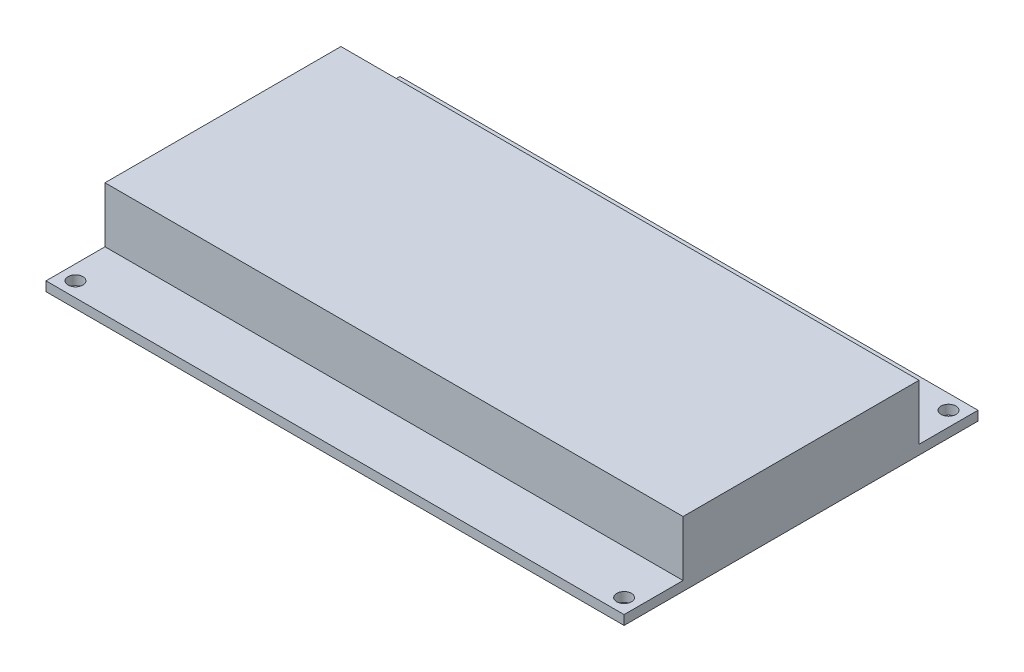
ISO-10303-21;
HEADER;
FILE_DESCRIPTION(('STEP AP214'),'2;1');
FILE_NAME('part.step','',(''),(''),'','','');
FILE_SCHEMA(('AUTOMOTIVE_DESIGN { 1 0 10303 214 1 1 1 1 }'));
ENDSEC;
DATA;
#1=APPLICATION_CONTEXT('core data for automotive mechanical design processes');
#2=APPLICATION_PROTOCOL_DEFINITION('international standard','automotive_design',2000,#1);
#3=PRODUCT_CONTEXT('',#1,'mechanical');
#4=PRODUCT('Part','Part','',(#3));
#5=PRODUCT_RELATED_PRODUCT_CATEGORY('part','',(#4));
#6=PRODUCT_DEFINITION_FORMATION('','',#4);
#7=PRODUCT_DEFINITION_CONTEXT('part definition',#1,'design');
#8=PRODUCT_DEFINITION('design','',#6,#7);
#9=PRODUCT_DEFINITION_SHAPE('','',#8);
#10=(LENGTH_UNIT() NAMED_UNIT(*) SI_UNIT(.MILLI.,.METRE.));
#11=(NAMED_UNIT(*) PLANE_ANGLE_UNIT() SI_UNIT($,.RADIAN.));
#12=(NAMED_UNIT(*) SI_UNIT($,.STERADIAN.) SOLID_ANGLE_UNIT());
#13=UNCERTAINTY_MEASURE_WITH_UNIT(LENGTH_MEASURE(1.E-05),#10,'distance_accuracy_value','');
#14=(GEOMETRIC_REPRESENTATION_CONTEXT(3) GLOBAL_UNCERTAINTY_ASSIGNED_CONTEXT((#13)) GLOBAL_UNIT_ASSIGNED_CONTEXT((#10,
#11,#12)) REPRESENTATION_CONTEXT('',''));
#15=CARTESIAN_POINT('',(0.,0.,0.));
#16=DIRECTION('',(0.,0.,1.));
#17=DIRECTION('',(1.,0.,0.));
#18=AXIS2_PLACEMENT_3D('',#15,#16,#17);
#19=CARTESIAN_POINT('',(0.,0.,0.));
#20=DIRECTION('',(0.,1.,0.));
#21=DIRECTION('',(0.,0.,1.));
#22=AXIS2_PLACEMENT_3D('',#19,#20,#21);
#23=PLANE('',#22);
#24=CARTESIAN_POINT('',(46.5,0.,-27.5));
#25=DIRECTION('',(0.,-1.,0.));
#26=DIRECTION('',(0.,0.,1.));
#27=AXIS2_PLACEMENT_3D('',#24,#25,#26);
#28=CIRCLE('',#27,1.25);
#29=CARTESIAN_POINT('',(46.5,0.,-26.25));
#30=VERTEX_POINT('',#29);
#31=EDGE_CURVE('E422',#30,#30,#28,.T.);
#32=ORIENTED_EDGE('',*,*,#31,.F.);
#33=EDGE_LOOP('',(#32));
#34=FACE_BOUND('',#33,.T.);
#35=CARTESIAN_POINT('',(-46.5,0.,-27.5));
#36=DIRECTION('',(0.,-1.,0.));
#37=DIRECTION('',(0.,0.,-1.));
#38=AXIS2_PLACEMENT_3D('',#35,#36,#37);
#39=CIRCLE('',#38,1.24999999999997);
#40=CARTESIAN_POINT('',(-46.5,0.,-28.75));
#41=VERTEX_POINT('',#40);
#42=EDGE_CURVE('E429',#41,#41,#39,.T.);
#43=ORIENTED_EDGE('',*,*,#42,.F.);
#44=EDGE_LOOP('',(#43));
#45=FACE_BOUND('',#44,.T.);
#46=CARTESIAN_POINT('',(-46.5,0.,27.5));
#47=DIRECTION('',(0.,-1.,0.));
#48=DIRECTION('',(0.,0.,1.));
#49=AXIS2_PLACEMENT_3D('',#46,#47,#48);
#50=CIRCLE('',#49,1.25000000000001);
#51=CARTESIAN_POINT('',(-46.5,0.,28.75));
#52=VERTEX_POINT('',#51);
#53=EDGE_CURVE('E440',#52,#52,#50,.T.);
#54=ORIENTED_EDGE('',*,*,#53,.F.);
#55=EDGE_LOOP('',(#54));
#56=FACE_BOUND('',#55,.T.);
#57=CARTESIAN_POINT('',(46.5,0.,27.5));
#58=DIRECTION('',(0.,-1.,0.));
#59=DIRECTION('',(0.,0.,-1.));
#60=AXIS2_PLACEMENT_3D('',#57,#58,#59);
#61=CIRCLE('',#60,1.25);
#62=CARTESIAN_POINT('',(46.5,0.,26.25));
#63=VERTEX_POINT('',#62);
#64=EDGE_CURVE('E258',#63,#63,#61,.T.);
#65=ORIENTED_EDGE('',*,*,#64,.F.);
#66=EDGE_LOOP('',(#65));
#67=FACE_BOUND('',#66,.T.);
#68=DIRECTION('',(0.,0.,-1.));
#69=VECTOR('',#68,1.);
#70=CARTESIAN_POINT('',(-39.,0.,-30.));
#71=LINE('',#70,#69);
#72=CARTESIAN_POINT('',(-39.,0.,-4.99999999999999));
#73=VERTEX_POINT('',#72);
#74=CARTESIAN_POINT('',(-39.,0.,-30.));
#75=VERTEX_POINT('',#74);
#76=EDGE_CURVE('E55',#73,#75,#71,.T.);
#77=ORIENTED_EDGE('',*,*,#76,.F.);
#78=DIRECTION('',(-1.,0.,0.));
#79=VECTOR('',#78,1.);
#80=CARTESIAN_POINT('',(-39.,0.,-4.99999999999999));
#81=LINE('',#80,#79);
#82=CARTESIAN_POINT('',(5.99999999999999,0.,-4.99999999999999));
#83=VERTEX_POINT('',#82);
#84=EDGE_CURVE('E149',#83,#73,#81,.T.);
#85=ORIENTED_EDGE('',*,*,#84,.F.);
#86=DIRECTION('',(0.,0.,1.));
#87=VECTOR('',#86,1.);
#88=CARTESIAN_POINT('',(5.99999999999999,0.,-30.));
#89=LINE('',#88,#87);
#90=CARTESIAN_POINT('',(5.99999999999999,0.,-30.));
#91=VERTEX_POINT('',#90);
#92=EDGE_CURVE('E244',#91,#83,#89,.T.);
#93=ORIENTED_EDGE('',*,*,#92,.F.);
#94=DIRECTION('',(-1.,0.,0.));
#95=VECTOR('',#94,1.);
#96=CARTESIAN_POINT('',(0.,0.,-30.));
#97=LINE('',#96,#95);
#98=CARTESIAN_POINT('',(49.,0.,-30.));
#99=VERTEX_POINT('',#98);
#100=EDGE_CURVE('E223',#99,#91,#97,.T.);
#101=ORIENTED_EDGE('',*,*,#100,.F.);
#102=DIRECTION('',(0.,0.,1.));
#103=VECTOR('',#102,1.);
#104=CARTESIAN_POINT('',(49.,0.,0.));
#105=LINE('',#104,#103);
#106=CARTESIAN_POINT('',(49.,0.,30.));
#107=VERTEX_POINT('',#106);
#108=EDGE_CURVE('E220',#99,#107,#105,.T.);
#109=ORIENTED_EDGE('',*,*,#108,.T.);
#110=DIRECTION('',(-1.,0.,0.));
#111=VECTOR('',#110,1.);
#112=CARTESIAN_POINT('',(0.,0.,30.));
#113=LINE('',#112,#111);
#114=CARTESIAN_POINT('',(-49.,0.,30.));
#115=VERTEX_POINT('',#114);
#116=EDGE_CURVE('E216',#107,#115,#113,.T.);
#117=ORIENTED_EDGE('',*,*,#116,.T.);
#118=DIRECTION('',(0.,0.,1.));
#119=VECTOR('',#118,1.);
#120=CARTESIAN_POINT('',(-49.,0.,0.));
#121=LINE('',#120,#119);
#122=CARTESIAN_POINT('',(-49.,0.,-30.));
#123=VERTEX_POINT('',#122);
#124=EDGE_CURVE('E196',#123,#115,#121,.T.);
#125=ORIENTED_EDGE('',*,*,#124,.F.);
#126=EDGE_CURVE('E60',#75,#123,#97,.T.);
#127=ORIENTED_EDGE('',*,*,#126,.F.);
#128=EDGE_LOOP('',(#77,#85,#93,#101,#109,#117,#125,#127));
#129=FACE_BOUND('',#128,.T.);
#130=ADVANCED_FACE('F39',(#34,#45,#56,#67,#129),#23,.F.);
#131=CARTESIAN_POINT('',(0.,1.6,0.));
#132=DIRECTION('',(0.,1.,0.));
#133=DIRECTION('',(0.,0.,1.));
#134=AXIS2_PLACEMENT_3D('',#131,#132,#133);
#135=PLANE('',#134);
#136=CARTESIAN_POINT('',(46.5,1.6,-27.5));
#137=DIRECTION('',(0.,1.,0.));
#138=DIRECTION('',(0.,0.,1.));
#139=AXIS2_PLACEMENT_3D('',#136,#137,#138);
#140=CIRCLE('',#139,1.25);
#141=CARTESIAN_POINT('',(46.5,1.6,-26.25));
#142=VERTEX_POINT('',#141);
#143=EDGE_CURVE('E420',#142,#142,#140,.F.);
#144=ORIENTED_EDGE('',*,*,#143,.T.);
#145=EDGE_LOOP('',(#144));
#146=FACE_BOUND('',#145,.T.);
#147=CARTESIAN_POINT('',(-46.5,1.6,-27.5));
#148=DIRECTION('',(0.,1.,0.));
#149=DIRECTION('',(0.,0.,1.));
#150=AXIS2_PLACEMENT_3D('',#147,#148,#149);
#151=CIRCLE('',#150,1.24999999999997);
#152=CARTESIAN_POINT('',(-46.5,1.6,-26.25));
#153=VERTEX_POINT('',#152);
#154=EDGE_CURVE('E424',#153,#153,#151,.F.);
#155=ORIENTED_EDGE('',*,*,#154,.T.);
#156=EDGE_LOOP('',(#155));
#157=FACE_BOUND('',#156,.T.);
#158=DIRECTION('',(0.,0.,1.));
#159=VECTOR('',#158,1.);
#160=CARTESIAN_POINT('',(-49.,1.6,0.));
#161=LINE('',#160,#159);
#162=CARTESIAN_POINT('',(-49.,1.6,-30.));
#163=VERTEX_POINT('',#162);
#164=CARTESIAN_POINT('',(-49.,1.6,-20.));
#165=VERTEX_POINT('',#164);
#166=EDGE_CURVE('E197',#163,#165,#161,.T.);
#167=ORIENTED_EDGE('',*,*,#166,.T.);
#168=DIRECTION('',(1.,0.,0.));
#169=VECTOR('',#168,1.);
#170=CARTESIAN_POINT('',(0.,1.6,-20.));
#171=LINE('',#170,#169);
#172=CARTESIAN_POINT('',(49.,1.6,-20.));
#173=VERTEX_POINT('',#172);
#174=EDGE_CURVE('E189',#165,#173,#171,.T.);
#175=ORIENTED_EDGE('',*,*,#174,.T.);
#176=DIRECTION('',(0.,0.,1.));
#177=VECTOR('',#176,1.);
#178=CARTESIAN_POINT('',(49.,1.6,0.));
#179=LINE('',#178,#177);
#180=CARTESIAN_POINT('',(49.,1.6,-30.));
#181=VERTEX_POINT('',#180);
#182=EDGE_CURVE('E206',#181,#173,#179,.T.);
#183=ORIENTED_EDGE('',*,*,#182,.F.);
#184=DIRECTION('',(-1.,0.,0.));
#185=VECTOR('',#184,1.);
#186=CARTESIAN_POINT('',(0.,1.6,-30.));
#187=LINE('',#186,#185);
#188=EDGE_CURVE('E210',#181,#163,#187,.T.);
#189=ORIENTED_EDGE('',*,*,#188,.T.);
#190=EDGE_LOOP('',(#167,#175,#183,#189));
#191=FACE_BOUND('',#190,.T.);
#192=ADVANCED_FACE('F277',(#146,#157,#191),#135,.T.);
#193=CARTESIAN_POINT('',(-49.,1.6,0.));
#194=DIRECTION('',(1.,0.,0.));
#195=DIRECTION('',(0.,0.,-1.));
#196=AXIS2_PLACEMENT_3D('',#193,#194,#195);
#197=PLANE('',#196);
#198=CARTESIAN_POINT('',(-49.,1.6,20.));
#199=VERTEX_POINT('',#198);
#200=CARTESIAN_POINT('',(-49.,1.6,30.));
#201=VERTEX_POINT('',#200);
#202=EDGE_CURVE('E201',#199,#201,#161,.T.);
#203=ORIENTED_EDGE('',*,*,#202,.F.);
#204=DIRECTION('',(0.,-1.,0.));
#205=VECTOR('',#204,1.);
#206=CARTESIAN_POINT('',(-49.,11.,20.));
#207=LINE('',#206,#205);
#208=CARTESIAN_POINT('',(-49.,11.,20.));
#209=VERTEX_POINT('',#208);
#210=EDGE_CURVE('E173',#209,#199,#207,.T.);
#211=ORIENTED_EDGE('',*,*,#210,.F.);
#212=DIRECTION('',(0.,0.,1.));
#213=VECTOR('',#212,1.);
#214=CARTESIAN_POINT('',(-49.,11.,0.));
#215=LINE('',#214,#213);
#216=CARTESIAN_POINT('',(-49.,11.,-20.));
#217=VERTEX_POINT('',#216);
#218=EDGE_CURVE('E170',#217,#209,#215,.T.);
#219=ORIENTED_EDGE('',*,*,#218,.F.);
#220=DIRECTION('',(0.,-1.,0.));
#221=VECTOR('',#220,1.);
#222=CARTESIAN_POINT('',(-49.,11.,-20.));
#223=LINE('',#222,#221);
#224=EDGE_CURVE('E177',#217,#165,#223,.T.);
#225=ORIENTED_EDGE('',*,*,#224,.T.);
#226=ORIENTED_EDGE('',*,*,#166,.F.);
#227=DIRECTION('',(0.,-1.,0.));
#228=VECTOR('',#227,1.);
#229=CARTESIAN_POINT('',(-49.,1.6,-30.));
#230=LINE('',#229,#228);
#231=EDGE_CURVE('E213',#163,#123,#230,.T.);
#232=ORIENTED_EDGE('',*,*,#231,.T.);
#233=ORIENTED_EDGE('',*,*,#124,.T.);
#234=DIRECTION('',(0.,-1.,0.));
#235=VECTOR('',#234,1.);
#236=CARTESIAN_POINT('',(-49.,1.6,30.));
#237=LINE('',#236,#235);
#238=EDGE_CURVE('E11',#201,#115,#237,.T.);
#239=ORIENTED_EDGE('',*,*,#238,.F.);
#240=EDGE_LOOP('',(#203,#211,#219,#225,#226,#232,#233,#239));
#241=FACE_BOUND('',#240,.T.);
#242=ADVANCED_FACE('F41',(#241),#197,.F.);
#243=CARTESIAN_POINT('',(0.,1.6,30.));
#244=DIRECTION('',(0.,0.,1.));
#245=DIRECTION('',(1.,0.,0.));
#246=AXIS2_PLACEMENT_3D('',#243,#244,#245);
#247=PLANE('',#246);
#248=ORIENTED_EDGE('',*,*,#116,.F.);
#249=DIRECTION('',(0.,-1.,0.));
#250=VECTOR('',#249,1.);
#251=CARTESIAN_POINT('',(49.,1.6,30.));
#252=LINE('',#251,#250);
#253=CARTESIAN_POINT('',(49.,1.6,30.));
#254=VERTEX_POINT('',#253);
#255=EDGE_CURVE('E48',#254,#107,#252,.T.);
#256=ORIENTED_EDGE('',*,*,#255,.F.);
#257=DIRECTION('',(-1.,0.,0.));
#258=VECTOR('',#257,1.);
#259=CARTESIAN_POINT('',(0.,1.6,30.));
#260=LINE('',#259,#258);
#261=EDGE_CURVE('E200',#254,#201,#260,.T.);
#262=ORIENTED_EDGE('',*,*,#261,.T.);
#263=ORIENTED_EDGE('',*,*,#238,.T.);
#264=EDGE_LOOP('',(#248,#256,#262,#263));
#265=FACE_BOUND('',#264,.T.);
#266=ADVANCED_FACE('F240',(#265),#247,.T.);
#267=CARTESIAN_POINT('',(49.,1.6,0.));
#268=DIRECTION('',(1.,0.,0.));
#269=DIRECTION('',(0.,0.,-1.));
#270=AXIS2_PLACEMENT_3D('',#267,#268,#269);
#271=PLANE('',#270);
#272=ORIENTED_EDGE('',*,*,#255,.T.);
#273=ORIENTED_EDGE('',*,*,#108,.F.);
#274=DIRECTION('',(0.,-1.,0.));
#275=VECTOR('',#274,1.);
#276=CARTESIAN_POINT('',(49.,1.6,-30.));
#277=LINE('',#276,#275);
#278=EDGE_CURVE('E229',#181,#99,#277,.T.);
#279=ORIENTED_EDGE('',*,*,#278,.F.);
#280=ORIENTED_EDGE('',*,*,#182,.T.);
#281=DIRECTION('',(0.,-1.,0.));
#282=VECTOR('',#281,1.);
#283=CARTESIAN_POINT('',(49.,11.,-20.));
#284=LINE('',#283,#282);
#285=CARTESIAN_POINT('',(49.,11.,-20.));
#286=VERTEX_POINT('',#285);
#287=EDGE_CURVE('E181',#286,#173,#284,.T.);
#288=ORIENTED_EDGE('',*,*,#287,.F.);
#289=DIRECTION('',(0.,0.,1.));
#290=VECTOR('',#289,1.);
#291=CARTESIAN_POINT('',(49.,11.,0.));
#292=LINE('',#291,#290);
#293=CARTESIAN_POINT('',(49.,11.,20.));
#294=VERTEX_POINT('',#293);
#295=EDGE_CURVE('E158',#286,#294,#292,.T.);
#296=ORIENTED_EDGE('',*,*,#295,.T.);
#297=DIRECTION('',(0.,-1.,0.));
#298=VECTOR('',#297,1.);
#299=CARTESIAN_POINT('',(49.,11.,20.));
#300=LINE('',#299,#298);
#301=CARTESIAN_POINT('',(49.,1.6,20.));
#302=VERTEX_POINT('',#301);
#303=EDGE_CURVE('E185',#294,#302,#300,.T.);
#304=ORIENTED_EDGE('',*,*,#303,.T.);
#305=EDGE_CURVE('E205',#302,#254,#179,.T.);
#306=ORIENTED_EDGE('',*,*,#305,.T.);
#307=EDGE_LOOP('',(#272,#273,#279,#280,#288,#296,#304,#306));
#308=FACE_BOUND('',#307,.T.);
#309=ADVANCED_FACE('F237',(#308),#271,.T.);
#310=CARTESIAN_POINT('',(0.,1.6,-30.));
#311=DIRECTION('',(0.,0.,1.));
#312=DIRECTION('',(1.,0.,0.));
#313=AXIS2_PLACEMENT_3D('',#310,#311,#312);
#314=PLANE('',#313);
#315=ORIENTED_EDGE('',*,*,#100,.T.);
#316=DIRECTION('',(0.,1.,0.));
#317=VECTOR('',#316,1.);
#318=CARTESIAN_POINT('',(5.99999999999999,-13.,-30.));
#319=LINE('',#318,#317);
#320=CARTESIAN_POINT('',(5.99999999999999,-13.,-30.));
#321=VERTEX_POINT('',#320);
#322=EDGE_CURVE('E134',#321,#91,#319,.T.);
#323=ORIENTED_EDGE('',*,*,#322,.F.);
#324=DIRECTION('',(1.,0.,0.));
#325=VECTOR('',#324,1.);
#326=CARTESIAN_POINT('',(-39.,-13.,-30.));
#327=LINE('',#326,#325);
#328=CARTESIAN_POINT('',(-39.,-13.,-30.));
#329=VERTEX_POINT('',#328);
#330=EDGE_CURVE('E127',#329,#321,#327,.T.);
#331=ORIENTED_EDGE('',*,*,#330,.F.);
#332=DIRECTION('',(0.,1.,0.));
#333=VECTOR('',#332,1.);
#334=CARTESIAN_POINT('',(-39.,-13.,-30.));
#335=LINE('',#334,#333);
#336=EDGE_CURVE('E132',#329,#75,#335,.T.);
#337=ORIENTED_EDGE('',*,*,#336,.T.);
#338=ORIENTED_EDGE('',*,*,#126,.T.);
#339=ORIENTED_EDGE('',*,*,#231,.F.);
#340=ORIENTED_EDGE('',*,*,#188,.F.);
#341=ORIENTED_EDGE('',*,*,#278,.T.);
#342=EDGE_LOOP('',(#315,#323,#331,#337,#338,#339,#340,#341));
#343=FACE_BOUND('',#342,.T.);
#344=ADVANCED_FACE('F130',(#343),#314,.F.);
#345=CARTESIAN_POINT('',(-46.5,1.6,27.5));
#346=DIRECTION('',(0.,1.,0.));
#347=DIRECTION('',(0.,0.,1.));
#348=AXIS2_PLACEMENT_3D('',#345,#346,#347);
#349=CIRCLE('',#348,1.25000000000001);
#350=CARTESIAN_POINT('',(-46.5,1.6,28.75));
#351=VERTEX_POINT('',#350);
#352=EDGE_CURVE('E445',#351,#351,#349,.F.);
#353=ORIENTED_EDGE('',*,*,#352,.T.);
#354=EDGE_LOOP('',(#353));
#355=FACE_BOUND('',#354,.T.);
#356=CARTESIAN_POINT('',(46.5,1.6,27.5));
#357=DIRECTION('',(0.,1.,0.));
#358=DIRECTION('',(0.,0.,1.));
#359=AXIS2_PLACEMENT_3D('',#356,#357,#358);
#360=CIRCLE('',#359,1.25);
#361=CARTESIAN_POINT('',(46.5,1.6,28.75));
#362=VERTEX_POINT('',#361);
#363=EDGE_CURVE('E437',#362,#362,#360,.F.);
#364=ORIENTED_EDGE('',*,*,#363,.T.);
#365=EDGE_LOOP('',(#364));
#366=FACE_BOUND('',#365,.T.);
#367=DIRECTION('',(1.,0.,0.));
#368=VECTOR('',#367,1.);
#369=CARTESIAN_POINT('',(0.,1.6,20.));
#370=LINE('',#369,#368);
#371=EDGE_CURVE('E192',#199,#302,#370,.T.);
#372=ORIENTED_EDGE('',*,*,#371,.F.);
#373=ORIENTED_EDGE('',*,*,#202,.T.);
#374=ORIENTED_EDGE('',*,*,#261,.F.);
#375=ORIENTED_EDGE('',*,*,#305,.F.);
#376=EDGE_LOOP('',(#372,#373,#374,#375));
#377=FACE_BOUND('',#376,.T.);
#378=ADVANCED_FACE('F285',(#355,#366,#377),#135,.T.);
#379=CARTESIAN_POINT('',(0.,11.,20.));
#380=DIRECTION('',(0.,0.,1.));
#381=DIRECTION('',(1.,0.,0.));
#382=AXIS2_PLACEMENT_3D('',#379,#380,#381);
#383=PLANE('',#382);
#384=ORIENTED_EDGE('',*,*,#210,.T.);
#385=ORIENTED_EDGE('',*,*,#371,.T.);
#386=ORIENTED_EDGE('',*,*,#303,.F.);
#387=DIRECTION('',(-1.,0.,0.));
#388=VECTOR('',#387,1.);
#389=CARTESIAN_POINT('',(0.,11.,20.));
#390=LINE('',#389,#388);
#391=EDGE_CURVE('E153',#294,#209,#390,.T.);
#392=ORIENTED_EDGE('',*,*,#391,.T.);
#393=EDGE_LOOP('',(#384,#385,#386,#392));
#394=FACE_BOUND('',#393,.T.);
#395=ADVANCED_FACE('F306',(#394),#383,.T.);
#396=CARTESIAN_POINT('',(0.,11.,-20.));
#397=DIRECTION('',(0.,0.,1.));
#398=DIRECTION('',(1.,0.,0.));
#399=AXIS2_PLACEMENT_3D('',#396,#397,#398);
#400=PLANE('',#399);
#401=ORIENTED_EDGE('',*,*,#174,.F.);
#402=ORIENTED_EDGE('',*,*,#224,.F.);
#403=DIRECTION('',(-1.,0.,0.));
#404=VECTOR('',#403,1.);
#405=CARTESIAN_POINT('',(0.,11.,-20.));
#406=LINE('',#405,#404);
#407=EDGE_CURVE('E167',#286,#217,#406,.T.);
#408=ORIENTED_EDGE('',*,*,#407,.F.);
#409=ORIENTED_EDGE('',*,*,#287,.T.);
#410=EDGE_LOOP('',(#401,#402,#408,#409));
#411=FACE_BOUND('',#410,.T.);
#412=ADVANCED_FACE('F316',(#411),#400,.F.);
#413=CARTESIAN_POINT('',(0.,11.,0.));
#414=DIRECTION('',(0.,1.,0.));
#415=DIRECTION('',(0.,0.,1.));
#416=AXIS2_PLACEMENT_3D('',#413,#414,#415);
#417=PLANE('',#416);
#418=ORIENTED_EDGE('',*,*,#391,.F.);
#419=ORIENTED_EDGE('',*,*,#295,.F.);
#420=ORIENTED_EDGE('',*,*,#407,.T.);
#421=ORIENTED_EDGE('',*,*,#218,.T.);
#422=EDGE_LOOP('',(#418,#419,#420,#421));
#423=FACE_BOUND('',#422,.T.);
#424=ADVANCED_FACE('F310',(#423),#417,.T.);
#425=CARTESIAN_POINT('',(-39.,-13.,-30.));
#426=DIRECTION('',(1.,0.,0.));
#427=DIRECTION('',(0.,0.,-1.));
#428=AXIS2_PLACEMENT_3D('',#425,#426,#427);
#429=PLANE('',#428);
#430=ORIENTED_EDGE('',*,*,#76,.T.);
#431=ORIENTED_EDGE('',*,*,#336,.F.);
#432=DIRECTION('',(0.,0.,-1.));
#433=VECTOR('',#432,1.);
#434=CARTESIAN_POINT('',(-39.,-13.,-30.));
#435=LINE('',#434,#433);
#436=CARTESIAN_POINT('',(-39.,-13.,-4.99999999999999));
#437=VERTEX_POINT('',#436);
#438=EDGE_CURVE('E139',#437,#329,#435,.T.);
#439=ORIENTED_EDGE('',*,*,#438,.F.);
#440=DIRECTION('',(0.,1.,0.));
#441=VECTOR('',#440,1.);
#442=CARTESIAN_POINT('',(-39.,-13.,-4.99999999999999));
#443=LINE('',#442,#441);
#444=EDGE_CURVE('E253',#437,#73,#443,.T.);
#445=ORIENTED_EDGE('',*,*,#444,.T.);
#446=EDGE_LOOP('',(#430,#431,#439,#445));
#447=FACE_BOUND('',#446,.T.);
#448=ADVANCED_FACE('F151',(#447),#429,.F.);
#449=CARTESIAN_POINT('',(5.99999999999999,-13.,-30.));
#450=DIRECTION('',(-1.,0.,0.));
#451=DIRECTION('',(0.,0.,1.));
#452=AXIS2_PLACEMENT_3D('',#449,#450,#451);
#453=PLANE('',#452);
#454=ORIENTED_EDGE('',*,*,#92,.T.);
#455=DIRECTION('',(0.,1.,0.));
#456=VECTOR('',#455,1.);
#457=CARTESIAN_POINT('',(5.99999999999999,-13.,-4.99999999999999));
#458=LINE('',#457,#456);
#459=CARTESIAN_POINT('',(5.99999999999999,-13.,-4.99999999999999));
#460=VERTEX_POINT('',#459);
#461=EDGE_CURVE('E160',#460,#83,#458,.T.);
#462=ORIENTED_EDGE('',*,*,#461,.F.);
#463=DIRECTION('',(0.,0.,1.));
#464=VECTOR('',#463,1.);
#465=CARTESIAN_POINT('',(5.99999999999999,-13.,-30.));
#466=LINE('',#465,#464);
#467=EDGE_CURVE('E138',#321,#460,#466,.T.);
#468=ORIENTED_EDGE('',*,*,#467,.F.);
#469=ORIENTED_EDGE('',*,*,#322,.T.);
#470=EDGE_LOOP('',(#454,#462,#468,#469));
#471=FACE_BOUND('',#470,.T.);
#472=ADVANCED_FACE('F247',(#471),#453,.F.);
#473=CARTESIAN_POINT('',(-39.,-13.,-4.99999999999999));
#474=DIRECTION('',(0.,0.,-1.));
#475=DIRECTION('',(-1.,0.,0.));
#476=AXIS2_PLACEMENT_3D('',#473,#474,#475);
#477=PLANE('',#476);
#478=ORIENTED_EDGE('',*,*,#84,.T.);
#479=ORIENTED_EDGE('',*,*,#444,.F.);
#480=DIRECTION('',(-1.,0.,0.));
#481=VECTOR('',#480,1.);
#482=CARTESIAN_POINT('',(-39.,-13.,-4.99999999999999));
#483=LINE('',#482,#481);
#484=EDGE_CURVE('E144',#460,#437,#483,.T.);
#485=ORIENTED_EDGE('',*,*,#484,.F.);
#486=ORIENTED_EDGE('',*,*,#461,.T.);
#487=EDGE_LOOP('',(#478,#479,#485,#486));
#488=FACE_BOUND('',#487,.T.);
#489=ADVANCED_FACE('F266',(#488),#477,.F.);
#490=CARTESIAN_POINT('',(0.,-13.,0.));
#491=DIRECTION('',(0.,1.,0.));
#492=DIRECTION('',(0.,0.,1.));
#493=AXIS2_PLACEMENT_3D('',#490,#491,#492);
#494=PLANE('',#493);
#495=ORIENTED_EDGE('',*,*,#438,.T.);
#496=ORIENTED_EDGE('',*,*,#330,.T.);
#497=ORIENTED_EDGE('',*,*,#467,.T.);
#498=ORIENTED_EDGE('',*,*,#484,.T.);
#499=EDGE_LOOP('',(#495,#496,#497,#498));
#500=FACE_BOUND('',#499,.T.);
#501=ADVANCED_FACE('F142',(#500),#494,.F.);
#502=CARTESIAN_POINT('',(46.5,11.001,27.5));
#503=DIRECTION('',(0.,-1.,0.));
#504=DIRECTION('',(0.,0.,-1.));
#505=AXIS2_PLACEMENT_3D('',#502,#503,#504);
#506=CYLINDRICAL_SURFACE('',#505,1.25);
#507=ORIENTED_EDGE('',*,*,#363,.F.);
#508=EDGE_LOOP('',(#507));
#509=FACE_BOUND('',#508,.T.);
#510=ORIENTED_EDGE('',*,*,#64,.T.);
#511=EDGE_LOOP('',(#510));
#512=FACE_BOUND('',#511,.T.);
#513=ADVANCED_FACE('F273',(#509,#512),#506,.F.);
#514=CARTESIAN_POINT('',(-46.5,11.001,27.5));
#515=DIRECTION('',(0.,-1.,0.));
#516=DIRECTION('',(0.,0.,-1.));
#517=AXIS2_PLACEMENT_3D('',#514,#515,#516);
#518=CYLINDRICAL_SURFACE('',#517,1.25000000000001);
#519=ORIENTED_EDGE('',*,*,#352,.F.);
#520=EDGE_LOOP('',(#519));
#521=FACE_BOUND('',#520,.T.);
#522=ORIENTED_EDGE('',*,*,#53,.T.);
#523=EDGE_LOOP('',(#522));
#524=FACE_BOUND('',#523,.T.);
#525=ADVANCED_FACE('F383',(#521,#524),#518,.F.);
#526=CARTESIAN_POINT('',(-46.5,11.001,-27.5));
#527=DIRECTION('',(0.,-1.,0.));
#528=DIRECTION('',(0.,0.,-1.));
#529=AXIS2_PLACEMENT_3D('',#526,#527,#528);
#530=CYLINDRICAL_SURFACE('',#529,1.24999999999997);
#531=ORIENTED_EDGE('',*,*,#154,.F.);
#532=EDGE_LOOP('',(#531));
#533=FACE_BOUND('',#532,.T.);
#534=ORIENTED_EDGE('',*,*,#42,.T.);
#535=EDGE_LOOP('',(#534));
#536=FACE_BOUND('',#535,.T.);
#537=ADVANCED_FACE('F393',(#533,#536),#530,.F.);
#538=CARTESIAN_POINT('',(46.5,11.001,-27.5));
#539=DIRECTION('',(0.,-1.,0.));
#540=DIRECTION('',(0.,0.,-1.));
#541=AXIS2_PLACEMENT_3D('',#538,#539,#540);
#542=CYLINDRICAL_SURFACE('',#541,1.25);
#543=ORIENTED_EDGE('',*,*,#143,.F.);
#544=EDGE_LOOP('',(#543));
#545=FACE_BOUND('',#544,.T.);
#546=ORIENTED_EDGE('',*,*,#31,.T.);
#547=EDGE_LOOP('',(#546));
#548=FACE_BOUND('',#547,.T.);
#549=ADVANCED_FACE('F403',(#545,#548),#542,.F.);
#550=CLOSED_SHELL('',(#130,#192,#242,#266,#309,#344,#378,#395,#412,#424,#448,#472,#489,#501,
#513,#525,#537,#549));
#551=MANIFOLD_SOLID_BREP('B2',#550);
#552=ADVANCED_BREP_SHAPE_REPRESENTATION('',(#18,#551),#14);
#553=SHAPE_DEFINITION_REPRESENTATION(#9,#552);
ENDSEC;
END-ISO-10303-21;
